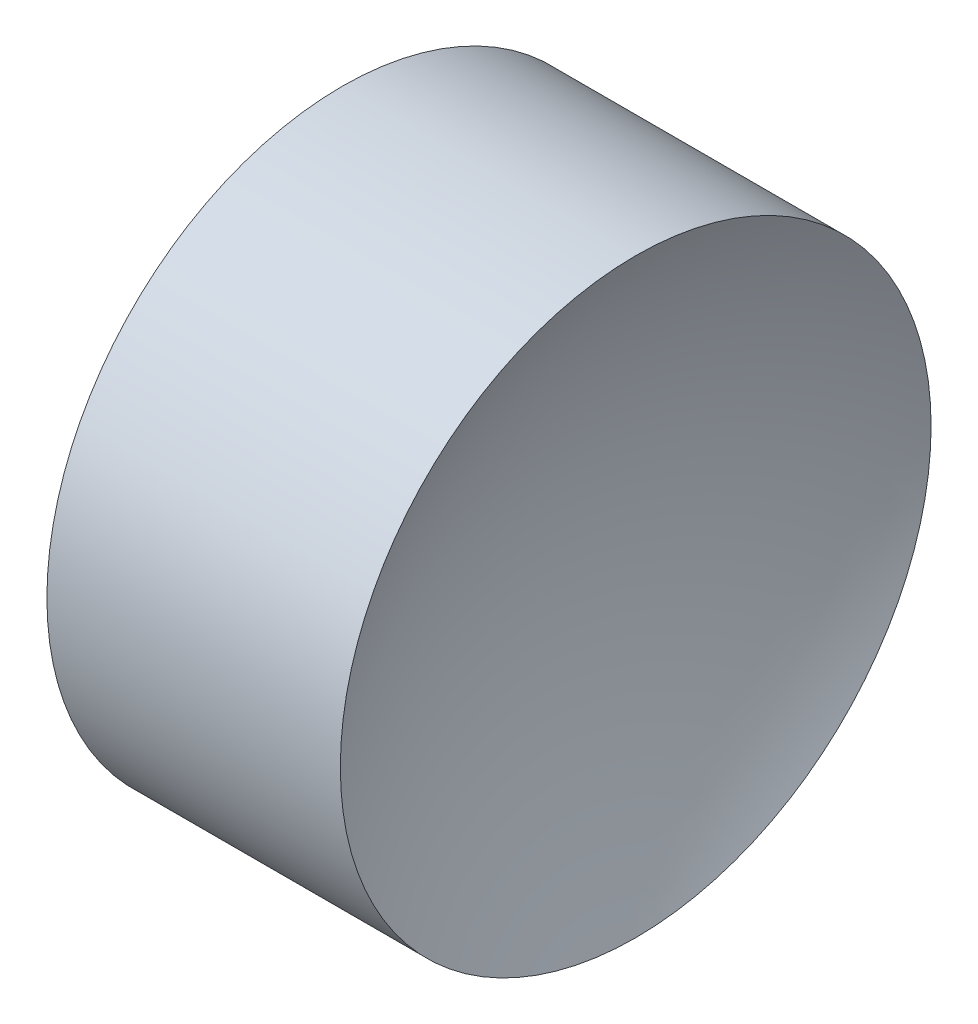
ISO-10303-21;
HEADER;
FILE_DESCRIPTION(('STEP AP214'),'2;1');
FILE_NAME('part.step','',(''),(''),'','','');
FILE_SCHEMA(('AUTOMOTIVE_DESIGN { 1 0 10303 214 1 1 1 1 }'));
ENDSEC;
DATA;
#1=APPLICATION_CONTEXT('core data for automotive mechanical design processes');
#2=APPLICATION_PROTOCOL_DEFINITION('international standard','automotive_design',2000,#1);
#3=PRODUCT_CONTEXT('',#1,'mechanical');
#4=PRODUCT('Part','Part','',(#3));
#5=PRODUCT_RELATED_PRODUCT_CATEGORY('part','',(#4));
#6=PRODUCT_DEFINITION_FORMATION('','',#4);
#7=PRODUCT_DEFINITION_CONTEXT('part definition',#1,'design');
#8=PRODUCT_DEFINITION('design','',#6,#7);
#9=PRODUCT_DEFINITION_SHAPE('','',#8);
#10=(LENGTH_UNIT() NAMED_UNIT(*) SI_UNIT(.MILLI.,.METRE.));
#11=(NAMED_UNIT(*) PLANE_ANGLE_UNIT() SI_UNIT($,.RADIAN.));
#12=(NAMED_UNIT(*) SI_UNIT($,.STERADIAN.) SOLID_ANGLE_UNIT());
#13=UNCERTAINTY_MEASURE_WITH_UNIT(LENGTH_MEASURE(1.E-05),#10,'distance_accuracy_value','');
#14=(GEOMETRIC_REPRESENTATION_CONTEXT(3) GLOBAL_UNCERTAINTY_ASSIGNED_CONTEXT((#13)) GLOBAL_UNIT_ASSIGNED_CONTEXT((#10,
#11,#12)) REPRESENTATION_CONTEXT('',''));
#15=CARTESIAN_POINT('',(0.,0.,0.));
#16=DIRECTION('',(0.,0.,1.));
#17=DIRECTION('',(1.,0.,0.));
#18=AXIS2_PLACEMENT_3D('',#15,#16,#17);
#19=CARTESIAN_POINT('',(7.21489500521976,6.52226028729874,0.));
#20=DIRECTION('',(-1.,0.,0.));
#21=DIRECTION('',(0.,1.,0.));
#22=AXIS2_PLACEMENT_3D('',#19,#20,#21);
#23=SPHERICAL_SURFACE('',#22,4.3);
#24=CARTESIAN_POINT('',(11.0214682673546,6.52226028729874,0.));
#25=DIRECTION('',(-1.,0.,0.));
#26=DIRECTION('',(0.,0.,1.));
#27=AXIS2_PLACEMENT_3D('',#24,#25,#26);
#28=CIRCLE('',#27,2.);
#29=CARTESIAN_POINT('',(11.0214682673546,6.52226028729874,2.));
#30=VERTEX_POINT('',#29);
#31=EDGE_CURVE('E41',#30,#30,#28,.T.);
#32=ORIENTED_EDGE('',*,*,#31,.T.);
#33=EDGE_LOOP('',(#32));
#34=FACE_BOUND('',#33,.T.);
#35=ADVANCED_FACE('F35',(#34),#23,.F.);
#36=CARTESIAN_POINT('',(16.8148950052198,6.52226028729874,0.));
#37=DIRECTION('',(-1.,0.,0.));
#38=DIRECTION('',(0.,-1.,0.));
#39=AXIS2_PLACEMENT_3D('',#36,#37,#38);
#40=SPHERICAL_SURFACE('',#39,4.3);
#41=CARTESIAN_POINT('',(13.0083217430849,6.52226028729874,0.));
#42=DIRECTION('',(-1.,0.,0.));
#43=DIRECTION('',(0.,0.,1.));
#44=AXIS2_PLACEMENT_3D('',#41,#42,#43);
#45=CIRCLE('',#44,2.);
#46=CARTESIAN_POINT('',(13.0083217430849,6.52226028729874,2.));
#47=VERTEX_POINT('',#46);
#48=EDGE_CURVE('E10',#47,#47,#45,.T.);
#49=ORIENTED_EDGE('',*,*,#48,.F.);
#50=EDGE_LOOP('',(#49));
#51=FACE_BOUND('',#50,.T.);
#52=ADVANCED_FACE('F50',(#51),#40,.F.);
#53=CARTESIAN_POINT('',(10.6124652785342,6.52226028729874,0.));
#54=DIRECTION('',(-1.,0.,0.));
#55=DIRECTION('',(0.,0.,1.));
#56=AXIS2_PLACEMENT_3D('',#53,#54,#55);
#57=CYLINDRICAL_SURFACE('',#56,2.);
#58=ORIENTED_EDGE('',*,*,#31,.F.);
#59=EDGE_LOOP('',(#58));
#60=FACE_BOUND('',#59,.T.);
#61=ORIENTED_EDGE('',*,*,#48,.T.);
#62=EDGE_LOOP('',(#61));
#63=FACE_BOUND('',#62,.T.);
#64=ADVANCED_FACE('F48',(#60,#63),#57,.T.);
#65=CLOSED_SHELL('',(#35,#52,#64));
#66=MANIFOLD_SOLID_BREP('B2',#65);
#67=ADVANCED_BREP_SHAPE_REPRESENTATION('',(#18,#66),#14);
#68=SHAPE_DEFINITION_REPRESENTATION(#9,#67);
ENDSEC;
END-ISO-10303-21;
